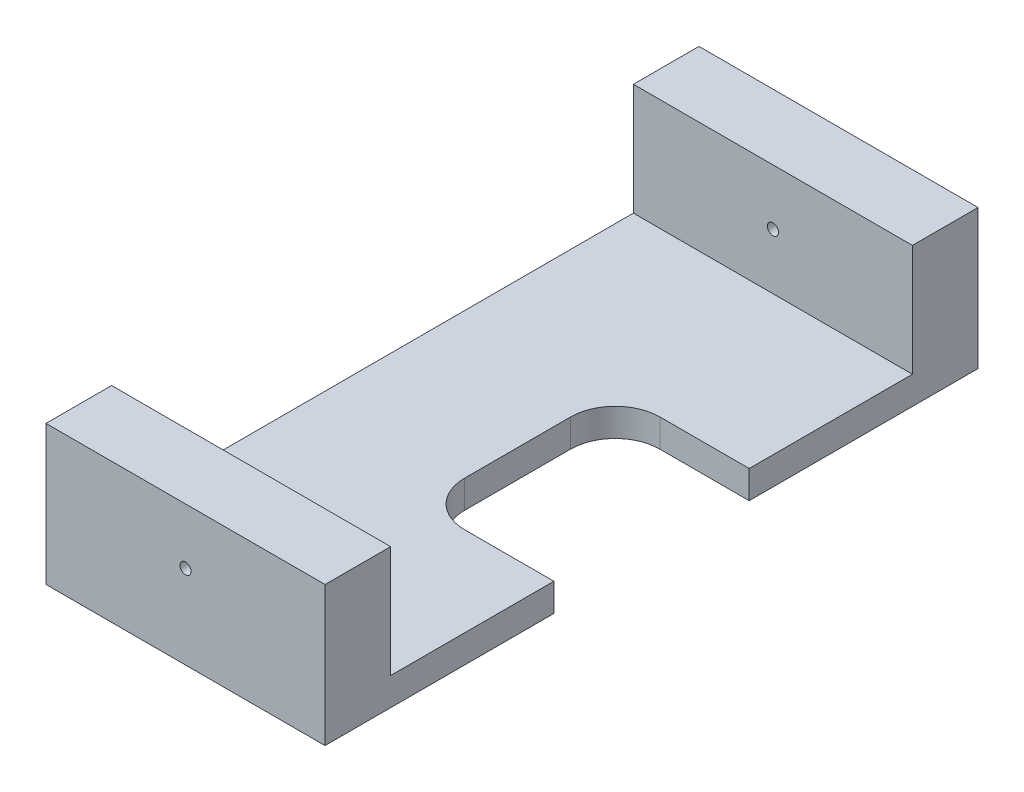
ISO-10303-21;
HEADER;
FILE_DESCRIPTION(('STEP AP214'),'2;1');
FILE_NAME('part.step','',(''),(''),'','','');
FILE_SCHEMA(('AUTOMOTIVE_DESIGN { 1 0 10303 214 1 1 1 1 }'));
ENDSEC;
DATA;
#1=APPLICATION_CONTEXT('core data for automotive mechanical design processes');
#2=APPLICATION_PROTOCOL_DEFINITION('international standard','automotive_design',2000,#1);
#3=PRODUCT_CONTEXT('',#1,'mechanical');
#4=PRODUCT('Part','Part','',(#3));
#5=PRODUCT_RELATED_PRODUCT_CATEGORY('part','',(#4));
#6=PRODUCT_DEFINITION_FORMATION('','',#4);
#7=PRODUCT_DEFINITION_CONTEXT('part definition',#1,'design');
#8=PRODUCT_DEFINITION('design','',#6,#7);
#9=PRODUCT_DEFINITION_SHAPE('','',#8);
#10=(LENGTH_UNIT() NAMED_UNIT(*) SI_UNIT(.MILLI.,.METRE.));
#11=(NAMED_UNIT(*) PLANE_ANGLE_UNIT() SI_UNIT($,.RADIAN.));
#12=(NAMED_UNIT(*) SI_UNIT($,.STERADIAN.) SOLID_ANGLE_UNIT());
#13=UNCERTAINTY_MEASURE_WITH_UNIT(LENGTH_MEASURE(1.E-05),#10,'distance_accuracy_value','');
#14=(GEOMETRIC_REPRESENTATION_CONTEXT(3) GLOBAL_UNCERTAINTY_ASSIGNED_CONTEXT((#13)) GLOBAL_UNIT_ASSIGNED_CONTEXT((#10,
#11,#12)) REPRESENTATION_CONTEXT('',''));
#15=CARTESIAN_POINT('',(0.,0.,0.));
#16=DIRECTION('',(0.,0.,1.));
#17=DIRECTION('',(1.,0.,0.));
#18=AXIS2_PLACEMENT_3D('',#15,#16,#17);
#19=CARTESIAN_POINT('',(25.,5.,58.5));
#20=DIRECTION('',(-1.,0.,0.));
#21=DIRECTION('',(0.,0.,1.));
#22=AXIS2_PLACEMENT_3D('',#19,#20,#21);
#23=PLANE('',#22);
#24=DIRECTION('',(0.,0.,-1.));
#25=VECTOR('',#24,1.);
#26=CARTESIAN_POINT('',(25.,0.,58.5));
#27=LINE('',#26,#25);
#28=CARTESIAN_POINT('',(25.,0.,58.5));
#29=VERTEX_POINT('',#28);
#30=CARTESIAN_POINT('',(25.,0.,17.5));
#31=VERTEX_POINT('',#30);
#32=EDGE_CURVE('E194',#29,#31,#27,.T.);
#33=ORIENTED_EDGE('',*,*,#32,.T.);
#34=DIRECTION('',(0.,1.,0.));
#35=VECTOR('',#34,1.);
#36=CARTESIAN_POINT('',(25.,-5.,17.5));
#37=LINE('',#36,#35);
#38=CARTESIAN_POINT('',(25.,5.,17.5));
#39=VERTEX_POINT('',#38);
#40=EDGE_CURVE('E270',#31,#39,#37,.T.);
#41=ORIENTED_EDGE('',*,*,#40,.T.);
#42=DIRECTION('',(0.,0.,-1.));
#43=VECTOR('',#42,1.);
#44=CARTESIAN_POINT('',(25.,5.,58.5));
#45=LINE('',#44,#43);
#46=CARTESIAN_POINT('',(25.,5.,46.75));
#47=VERTEX_POINT('',#46);
#48=EDGE_CURVE('E175',#47,#39,#45,.T.);
#49=ORIENTED_EDGE('',*,*,#48,.F.);
#50=DIRECTION('',(0.,-1.,0.));
#51=VECTOR('',#50,1.);
#52=CARTESIAN_POINT('',(25.,25.,46.75));
#53=LINE('',#52,#51);
#54=CARTESIAN_POINT('',(25.,25.,46.75));
#55=VERTEX_POINT('',#54);
#56=EDGE_CURVE('E274',#55,#47,#53,.T.);
#57=ORIENTED_EDGE('',*,*,#56,.F.);
#58=DIRECTION('',(0.,0.,-1.));
#59=VECTOR('',#58,1.);
#60=CARTESIAN_POINT('',(25.,25.,46.75));
#61=LINE('',#60,#59);
#62=CARTESIAN_POINT('',(25.,25.,58.5));
#63=VERTEX_POINT('',#62);
#64=EDGE_CURVE('E256',#63,#55,#61,.T.);
#65=ORIENTED_EDGE('',*,*,#64,.F.);
#66=DIRECTION('',(0.,-1.,0.));
#67=VECTOR('',#66,1.);
#68=CARTESIAN_POINT('',(25.,5.,58.5));
#69=LINE('',#68,#67);
#70=EDGE_CURVE('E203',#63,#29,#69,.T.);
#71=ORIENTED_EDGE('',*,*,#70,.T.);
#72=EDGE_LOOP('',(#33,#41,#49,#57,#65,#71));
#73=FACE_BOUND('',#72,.T.);
#74=ADVANCED_FACE('F45',(#73),#23,.F.);
#75=CARTESIAN_POINT('',(0.,5.,0.));
#76=DIRECTION('',(0.,-1.,0.));
#77=DIRECTION('',(0.,0.,-1.));
#78=AXIS2_PLACEMENT_3D('',#75,#76,#77);
#79=PLANE('',#78);
#80=ORIENTED_EDGE('',*,*,#48,.T.);
#81=DIRECTION('',(1.,0.,0.));
#82=VECTOR('',#81,1.);
#83=CARTESIAN_POINT('',(9.00000000000006,5.,17.5));
#84=LINE('',#83,#82);
#85=CARTESIAN_POINT('',(9.,5.,17.5));
#86=VERTEX_POINT('',#85);
#87=EDGE_CURVE('E157',#86,#39,#84,.T.);
#88=ORIENTED_EDGE('',*,*,#87,.F.);
#89=CARTESIAN_POINT('',(9.,5.,9.50000000000001));
#90=DIRECTION('',(0.,1.,0.));
#91=DIRECTION('',(0.,0.,1.));
#92=AXIS2_PLACEMENT_3D('',#89,#90,#91);
#93=CIRCLE('',#92,8.);
#94=CARTESIAN_POINT('',(1.,5.,9.49999999999995));
#95=VERTEX_POINT('',#94);
#96=EDGE_CURVE('E323',#95,#86,#93,.T.);
#97=ORIENTED_EDGE('',*,*,#96,.F.);
#98=DIRECTION('',(0.,0.,1.));
#99=VECTOR('',#98,1.);
#100=CARTESIAN_POINT('',(1.,5.,-9.49999999999994));
#101=LINE('',#100,#99);
#102=CARTESIAN_POINT('',(1.,5.,-9.49999999999994));
#103=VERTEX_POINT('',#102);
#104=EDGE_CURVE('E237',#103,#95,#101,.T.);
#105=ORIENTED_EDGE('',*,*,#104,.F.);
#106=CARTESIAN_POINT('',(9.,5.,-9.5));
#107=DIRECTION('',(0.,1.,0.));
#108=DIRECTION('',(0.,0.,1.));
#109=AXIS2_PLACEMENT_3D('',#106,#107,#108);
#110=CIRCLE('',#109,8.);
#111=CARTESIAN_POINT('',(9.00000000000006,5.,-17.5));
#112=VERTEX_POINT('',#111);
#113=EDGE_CURVE('E165',#112,#103,#110,.T.);
#114=ORIENTED_EDGE('',*,*,#113,.F.);
#115=DIRECTION('',(-1.,0.,0.));
#116=VECTOR('',#115,1.);
#117=CARTESIAN_POINT('',(25.,5.,-17.5));
#118=LINE('',#117,#116);
#119=CARTESIAN_POINT('',(25.,5.,-17.5));
#120=VERTEX_POINT('',#119);
#121=EDGE_CURVE('E149',#120,#112,#118,.T.);
#122=ORIENTED_EDGE('',*,*,#121,.F.);
#123=CARTESIAN_POINT('',(25.,5.,-46.75));
#124=VERTEX_POINT('',#123);
#125=EDGE_CURVE('E161',#120,#124,#45,.T.);
#126=ORIENTED_EDGE('',*,*,#125,.T.);
#127=DIRECTION('',(1.,0.,0.));
#128=VECTOR('',#127,1.);
#129=CARTESIAN_POINT('',(-25.,5.,-46.75));
#130=LINE('',#129,#128);
#131=CARTESIAN_POINT('',(-25.,5.,-46.75));
#132=VERTEX_POINT('',#131);
#133=EDGE_CURVE('E278',#132,#124,#130,.T.);
#134=ORIENTED_EDGE('',*,*,#133,.F.);
#135=DIRECTION('',(0.,0.,-1.));
#136=VECTOR('',#135,1.);
#137=CARTESIAN_POINT('',(-25.,5.,58.5));
#138=LINE('',#137,#136);
#139=CARTESIAN_POINT('',(-25.,5.,46.75));
#140=VERTEX_POINT('',#139);
#141=EDGE_CURVE('E70',#140,#132,#138,.T.);
#142=ORIENTED_EDGE('',*,*,#141,.F.);
#143=DIRECTION('',(-1.,0.,0.));
#144=VECTOR('',#143,1.);
#145=CARTESIAN_POINT('',(-25.,5.,46.75));
#146=LINE('',#145,#144);
#147=EDGE_CURVE('E257',#47,#140,#146,.T.);
#148=ORIENTED_EDGE('',*,*,#147,.F.);
#149=EDGE_LOOP('',(#80,#88,#97,#105,#114,#122,#126,#134,#142,#148));
#150=FACE_BOUND('',#149,.T.);
#151=ADVANCED_FACE('F160',(#150),#79,.F.);
#152=CARTESIAN_POINT('',(-25.,5.,58.5));
#153=DIRECTION('',(-1.,0.,0.));
#154=DIRECTION('',(0.,0.,1.));
#155=AXIS2_PLACEMENT_3D('',#152,#153,#154);
#156=PLANE('',#155);
#157=DIRECTION('',(0.,0.,-1.));
#158=VECTOR('',#157,1.);
#159=CARTESIAN_POINT('',(-25.,0.,58.5));
#160=LINE('',#159,#158);
#161=CARTESIAN_POINT('',(-25.,0.,58.5));
#162=VERTEX_POINT('',#161);
#163=CARTESIAN_POINT('',(-25.,0.,-58.5));
#164=VERTEX_POINT('',#163);
#165=EDGE_CURVE('E184',#162,#164,#160,.T.);
#166=ORIENTED_EDGE('',*,*,#165,.F.);
#167=DIRECTION('',(0.,-1.,0.));
#168=VECTOR('',#167,1.);
#169=CARTESIAN_POINT('',(-25.,5.,58.5));
#170=LINE('',#169,#168);
#171=CARTESIAN_POINT('',(-25.,25.,58.5));
#172=VERTEX_POINT('',#171);
#173=EDGE_CURVE('E200',#172,#162,#170,.T.);
#174=ORIENTED_EDGE('',*,*,#173,.F.);
#175=DIRECTION('',(0.,0.,1.));
#176=VECTOR('',#175,1.);
#177=CARTESIAN_POINT('',(-25.,25.,58.5));
#178=LINE('',#177,#176);
#179=CARTESIAN_POINT('',(-25.,25.,46.75));
#180=VERTEX_POINT('',#179);
#181=EDGE_CURVE('E263',#180,#172,#178,.T.);
#182=ORIENTED_EDGE('',*,*,#181,.F.);
#183=DIRECTION('',(0.,-1.,0.));
#184=VECTOR('',#183,1.);
#185=CARTESIAN_POINT('',(-25.,25.,46.75));
#186=LINE('',#185,#184);
#187=EDGE_CURVE('E267',#180,#140,#186,.T.);
#188=ORIENTED_EDGE('',*,*,#187,.T.);
#189=ORIENTED_EDGE('',*,*,#141,.T.);
#190=DIRECTION('',(0.,-1.,0.));
#191=VECTOR('',#190,1.);
#192=CARTESIAN_POINT('',(-25.,25.,-46.75));
#193=LINE('',#192,#191);
#194=CARTESIAN_POINT('',(-25.,25.,-46.75));
#195=VERTEX_POINT('',#194);
#196=EDGE_CURVE('E189',#195,#132,#193,.T.);
#197=ORIENTED_EDGE('',*,*,#196,.F.);
#198=DIRECTION('',(0.,0.,1.));
#199=VECTOR('',#198,1.);
#200=CARTESIAN_POINT('',(-25.,25.,-58.5));
#201=LINE('',#200,#199);
#202=CARTESIAN_POINT('',(-25.,25.,-58.5));
#203=VERTEX_POINT('',#202);
#204=EDGE_CURVE('E283',#203,#195,#201,.T.);
#205=ORIENTED_EDGE('',*,*,#204,.F.);
#206=DIRECTION('',(0.,-1.,0.));
#207=VECTOR('',#206,1.);
#208=CARTESIAN_POINT('',(-25.,5.,-58.5));
#209=LINE('',#208,#207);
#210=EDGE_CURVE('E179',#203,#164,#209,.T.);
#211=ORIENTED_EDGE('',*,*,#210,.T.);
#212=EDGE_LOOP('',(#166,#174,#182,#188,#189,#197,#205,#211));
#213=FACE_BOUND('',#212,.T.);
#214=ADVANCED_FACE('F47',(#213),#156,.T.);
#215=CARTESIAN_POINT('',(-25.,5.,58.5));
#216=DIRECTION('',(0.,0.,-1.));
#217=DIRECTION('',(-1.,0.,0.));
#218=AXIS2_PLACEMENT_3D('',#215,#216,#217);
#219=PLANE('',#218);
#220=CARTESIAN_POINT('',(0.,15.,58.5));
#221=DIRECTION('',(0.,0.,-1.));
#222=DIRECTION('',(-1.,0.,0.));
#223=AXIS2_PLACEMENT_3D('',#220,#221,#222);
#224=CIRCLE('',#223,1.);
#225=CARTESIAN_POINT('',(-1.,15.,58.5));
#226=VERTEX_POINT('',#225);
#227=EDGE_CURVE('E337',#226,#226,#224,.T.);
#228=ORIENTED_EDGE('',*,*,#227,.T.);
#229=EDGE_LOOP('',(#228));
#230=FACE_BOUND('',#229,.T.);
#231=DIRECTION('',(1.,0.,0.));
#232=VECTOR('',#231,1.);
#233=CARTESIAN_POINT('',(-25.,0.,58.5));
#234=LINE('',#233,#232);
#235=EDGE_CURVE('E180',#162,#29,#234,.T.);
#236=ORIENTED_EDGE('',*,*,#235,.T.);
#237=ORIENTED_EDGE('',*,*,#70,.F.);
#238=DIRECTION('',(1.,0.,0.));
#239=VECTOR('',#238,1.);
#240=CARTESIAN_POINT('',(25.,25.,58.5));
#241=LINE('',#240,#239);
#242=EDGE_CURVE('E252',#172,#63,#241,.T.);
#243=ORIENTED_EDGE('',*,*,#242,.F.);
#244=ORIENTED_EDGE('',*,*,#173,.T.);
#245=EDGE_LOOP('',(#236,#237,#243,#244));
#246=FACE_BOUND('',#245,.T.);
#247=ADVANCED_FACE('F368',(#230,#246),#219,.F.);
#248=ORIENTED_EDGE('',*,*,#125,.F.);
#249=DIRECTION('',(0.,1.,0.));
#250=VECTOR('',#249,1.);
#251=CARTESIAN_POINT('',(25.,-5.,-17.5));
#252=LINE('',#251,#250);
#253=CARTESIAN_POINT('',(25.,0.,-17.5));
#254=VERTEX_POINT('',#253);
#255=EDGE_CURVE('E146',#254,#120,#252,.T.);
#256=ORIENTED_EDGE('',*,*,#255,.F.);
#257=CARTESIAN_POINT('',(25.,0.,-58.5));
#258=VERTEX_POINT('',#257);
#259=EDGE_CURVE('E193',#254,#258,#27,.T.);
#260=ORIENTED_EDGE('',*,*,#259,.T.);
#261=DIRECTION('',(0.,-1.,0.));
#262=VECTOR('',#261,1.);
#263=CARTESIAN_POINT('',(25.,5.,-58.5));
#264=LINE('',#263,#262);
#265=CARTESIAN_POINT('',(25.,25.,-58.5));
#266=VERTEX_POINT('',#265);
#267=EDGE_CURVE('E207',#266,#258,#264,.T.);
#268=ORIENTED_EDGE('',*,*,#267,.F.);
#269=DIRECTION('',(0.,0.,-1.));
#270=VECTOR('',#269,1.);
#271=CARTESIAN_POINT('',(25.,25.,-46.75));
#272=LINE('',#271,#270);
#273=CARTESIAN_POINT('',(25.,25.,-46.75));
#274=VERTEX_POINT('',#273);
#275=EDGE_CURVE('E289',#274,#266,#272,.T.);
#276=ORIENTED_EDGE('',*,*,#275,.F.);
#277=DIRECTION('',(0.,-1.,0.));
#278=VECTOR('',#277,1.);
#279=CARTESIAN_POINT('',(25.,25.,-46.75));
#280=LINE('',#279,#278);
#281=EDGE_CURVE('E173',#274,#124,#280,.T.);
#282=ORIENTED_EDGE('',*,*,#281,.T.);
#283=EDGE_LOOP('',(#248,#256,#260,#268,#276,#282));
#284=FACE_BOUND('',#283,.T.);
#285=ADVANCED_FACE('F170',(#284),#23,.F.);
#286=CARTESIAN_POINT('',(-25.,5.,-58.5));
#287=DIRECTION('',(0.,0.,-1.));
#288=DIRECTION('',(-1.,0.,0.));
#289=AXIS2_PLACEMENT_3D('',#286,#287,#288);
#290=PLANE('',#289);
#291=CARTESIAN_POINT('',(0.,15.,-58.5));
#292=DIRECTION('',(0.,0.,-1.));
#293=DIRECTION('',(-1.,0.,0.));
#294=AXIS2_PLACEMENT_3D('',#291,#292,#293);
#295=CIRCLE('',#294,1.);
#296=CARTESIAN_POINT('',(-1.,15.,-58.5));
#297=VERTEX_POINT('',#296);
#298=EDGE_CURVE('E333',#297,#297,#295,.T.);
#299=ORIENTED_EDGE('',*,*,#298,.F.);
#300=EDGE_LOOP('',(#299));
#301=FACE_BOUND('',#300,.T.);
#302=DIRECTION('',(1.,0.,0.));
#303=VECTOR('',#302,1.);
#304=CARTESIAN_POINT('',(-25.,0.,-58.5));
#305=LINE('',#304,#303);
#306=EDGE_CURVE('E188',#164,#258,#305,.T.);
#307=ORIENTED_EDGE('',*,*,#306,.F.);
#308=ORIENTED_EDGE('',*,*,#210,.F.);
#309=DIRECTION('',(-1.,0.,0.));
#310=VECTOR('',#309,1.);
#311=CARTESIAN_POINT('',(25.,25.,-58.5));
#312=LINE('',#311,#310);
#313=EDGE_CURVE('E279',#266,#203,#312,.T.);
#314=ORIENTED_EDGE('',*,*,#313,.F.);
#315=ORIENTED_EDGE('',*,*,#267,.T.);
#316=EDGE_LOOP('',(#307,#308,#314,#315));
#317=FACE_BOUND('',#316,.T.);
#318=ADVANCED_FACE('F367',(#301,#317),#290,.T.);
#319=CARTESIAN_POINT('',(0.,0.,0.));
#320=DIRECTION('',(0.,-1.,0.));
#321=DIRECTION('',(0.,0.,-1.));
#322=AXIS2_PLACEMENT_3D('',#319,#320,#321);
#323=PLANE('',#322);
#324=DIRECTION('',(-1.,0.,0.));
#325=VECTOR('',#324,1.);
#326=CARTESIAN_POINT('',(0.,0.,17.5));
#327=LINE('',#326,#325);
#328=CARTESIAN_POINT('',(9.,0.,17.5));
#329=VERTEX_POINT('',#328);
#330=EDGE_CURVE('E11',#31,#329,#327,.T.);
#331=ORIENTED_EDGE('',*,*,#330,.F.);
#332=ORIENTED_EDGE('',*,*,#32,.F.);
#333=ORIENTED_EDGE('',*,*,#235,.F.);
#334=ORIENTED_EDGE('',*,*,#165,.T.);
#335=ORIENTED_EDGE('',*,*,#306,.T.);
#336=ORIENTED_EDGE('',*,*,#259,.F.);
#337=DIRECTION('',(1.,0.,0.));
#338=VECTOR('',#337,1.);
#339=CARTESIAN_POINT('',(0.,0.,-17.5));
#340=LINE('',#339,#338);
#341=CARTESIAN_POINT('',(9.00000000000006,0.,-17.5));
#342=VERTEX_POINT('',#341);
#343=EDGE_CURVE('E152',#342,#254,#340,.T.);
#344=ORIENTED_EDGE('',*,*,#343,.F.);
#345=CARTESIAN_POINT('',(9.,0.,-9.5));
#346=DIRECTION('',(0.,-1.,0.));
#347=DIRECTION('',(0.,0.,-1.));
#348=AXIS2_PLACEMENT_3D('',#345,#346,#347);
#349=CIRCLE('',#348,8.);
#350=CARTESIAN_POINT('',(1.,0.,-9.49999999999994));
#351=VERTEX_POINT('',#350);
#352=EDGE_CURVE('E215',#351,#342,#349,.T.);
#353=ORIENTED_EDGE('',*,*,#352,.F.);
#354=DIRECTION('',(0.,0.,-1.));
#355=VECTOR('',#354,1.);
#356=CARTESIAN_POINT('',(1.,0.,0.));
#357=LINE('',#356,#355);
#358=CARTESIAN_POINT('',(1.,0.,9.49999999999995));
#359=VERTEX_POINT('',#358);
#360=EDGE_CURVE('E218',#359,#351,#357,.T.);
#361=ORIENTED_EDGE('',*,*,#360,.F.);
#362=CARTESIAN_POINT('',(9.,0.,9.50000000000001));
#363=DIRECTION('',(0.,-1.,0.));
#364=DIRECTION('',(0.,0.,-1.));
#365=AXIS2_PLACEMENT_3D('',#362,#363,#364);
#366=CIRCLE('',#365,8.);
#367=EDGE_CURVE('E55',#329,#359,#366,.T.);
#368=ORIENTED_EDGE('',*,*,#367,.F.);
#369=EDGE_LOOP('',(#331,#332,#333,#334,#335,#336,#344,#353,#361,#368));
#370=FACE_BOUND('',#369,.T.);
#371=ADVANCED_FACE('F243',(#370),#323,.T.);
#372=CARTESIAN_POINT('',(-25.,25.,-46.75));
#373=DIRECTION('',(0.,0.,-1.));
#374=DIRECTION('',(-1.,0.,0.));
#375=AXIS2_PLACEMENT_3D('',#372,#373,#374);
#376=PLANE('',#375);
#377=CARTESIAN_POINT('',(0.,15.,-46.75));
#378=DIRECTION('',(0.,0.,-1.));
#379=DIRECTION('',(-1.,0.,0.));
#380=AXIS2_PLACEMENT_3D('',#377,#378,#379);
#381=CIRCLE('',#380,1.);
#382=CARTESIAN_POINT('',(-1.,15.,-46.75));
#383=VERTEX_POINT('',#382);
#384=EDGE_CURVE('E167',#383,#383,#381,.T.);
#385=ORIENTED_EDGE('',*,*,#384,.T.);
#386=EDGE_LOOP('',(#385));
#387=FACE_BOUND('',#386,.T.);
#388=ORIENTED_EDGE('',*,*,#133,.T.);
#389=ORIENTED_EDGE('',*,*,#281,.F.);
#390=DIRECTION('',(1.,0.,0.));
#391=VECTOR('',#390,1.);
#392=CARTESIAN_POINT('',(-25.,25.,-46.75));
#393=LINE('',#392,#391);
#394=EDGE_CURVE('E286',#195,#274,#393,.T.);
#395=ORIENTED_EDGE('',*,*,#394,.F.);
#396=ORIENTED_EDGE('',*,*,#196,.T.);
#397=EDGE_LOOP('',(#388,#389,#395,#396));
#398=FACE_BOUND('',#397,.T.);
#399=ADVANCED_FACE('F301',(#387,#398),#376,.F.);
#400=CARTESIAN_POINT('',(0.,25.,0.));
#401=DIRECTION('',(0.,1.,0.));
#402=DIRECTION('',(0.,0.,1.));
#403=AXIS2_PLACEMENT_3D('',#400,#401,#402);
#404=PLANE('',#403);
#405=ORIENTED_EDGE('',*,*,#313,.T.);
#406=ORIENTED_EDGE('',*,*,#204,.T.);
#407=ORIENTED_EDGE('',*,*,#394,.T.);
#408=ORIENTED_EDGE('',*,*,#275,.T.);
#409=EDGE_LOOP('',(#405,#406,#407,#408));
#410=FACE_BOUND('',#409,.T.);
#411=ADVANCED_FACE('F383',(#410),#404,.T.);
#412=CARTESIAN_POINT('',(-25.,25.,46.75));
#413=DIRECTION('',(0.,0.,1.));
#414=DIRECTION('',(1.,0.,0.));
#415=AXIS2_PLACEMENT_3D('',#412,#413,#414);
#416=PLANE('',#415);
#417=CARTESIAN_POINT('',(0.,15.,46.75));
#418=DIRECTION('',(0.,0.,1.));
#419=DIRECTION('',(1.,0.,0.));
#420=AXIS2_PLACEMENT_3D('',#417,#418,#419);
#421=CIRCLE('',#420,1.);
#422=CARTESIAN_POINT('',(1.,15.,46.75));
#423=VERTEX_POINT('',#422);
#424=EDGE_CURVE('E49',#423,#423,#421,.T.);
#425=ORIENTED_EDGE('',*,*,#424,.T.);
#426=EDGE_LOOP('',(#425));
#427=FACE_BOUND('',#426,.T.);
#428=ORIENTED_EDGE('',*,*,#147,.T.);
#429=ORIENTED_EDGE('',*,*,#187,.F.);
#430=DIRECTION('',(-1.,0.,0.));
#431=VECTOR('',#430,1.);
#432=CARTESIAN_POINT('',(-25.,25.,46.75));
#433=LINE('',#432,#431);
#434=EDGE_CURVE('E260',#55,#180,#433,.T.);
#435=ORIENTED_EDGE('',*,*,#434,.F.);
#436=ORIENTED_EDGE('',*,*,#56,.T.);
#437=EDGE_LOOP('',(#428,#429,#435,#436));
#438=FACE_BOUND('',#437,.T.);
#439=ADVANCED_FACE('F309',(#427,#438),#416,.F.);
#440=CARTESIAN_POINT('',(0.,25.,0.));
#441=DIRECTION('',(0.,-1.,0.));
#442=DIRECTION('',(0.,0.,-1.));
#443=AXIS2_PLACEMENT_3D('',#440,#441,#442);
#444=PLANE('',#443);
#445=ORIENTED_EDGE('',*,*,#242,.T.);
#446=ORIENTED_EDGE('',*,*,#64,.T.);
#447=ORIENTED_EDGE('',*,*,#434,.T.);
#448=ORIENTED_EDGE('',*,*,#181,.T.);
#449=EDGE_LOOP('',(#445,#446,#447,#448));
#450=FACE_BOUND('',#449,.T.);
#451=ADVANCED_FACE('F390',(#450),#444,.F.);
#452=CARTESIAN_POINT('',(9.00000000000006,-5.,17.5));
#453=DIRECTION('',(0.,0.,1.));
#454=DIRECTION('',(1.,0.,0.));
#455=AXIS2_PLACEMENT_3D('',#452,#453,#454);
#456=PLANE('',#455);
#457=ORIENTED_EDGE('',*,*,#330,.T.);
#458=DIRECTION('',(0.,1.,0.));
#459=VECTOR('',#458,1.);
#460=CARTESIAN_POINT('',(9.,-5.,17.5));
#461=LINE('',#460,#459);
#462=EDGE_CURVE('E230',#329,#86,#461,.T.);
#463=ORIENTED_EDGE('',*,*,#462,.T.);
#464=ORIENTED_EDGE('',*,*,#87,.T.);
#465=ORIENTED_EDGE('',*,*,#40,.F.);
#466=EDGE_LOOP('',(#457,#463,#464,#465));
#467=FACE_BOUND('',#466,.T.);
#468=ADVANCED_FACE('F392',(#467),#456,.F.);
#469=CARTESIAN_POINT('',(9.,-5.,9.50000000000001));
#470=DIRECTION('',(0.,1.,0.));
#471=DIRECTION('',(0.,0.,1.));
#472=AXIS2_PLACEMENT_3D('',#469,#470,#471);
#473=CYLINDRICAL_SURFACE('',#472,8.);
#474=ORIENTED_EDGE('',*,*,#367,.T.);
#475=DIRECTION('',(0.,1.,0.));
#476=VECTOR('',#475,1.);
#477=CARTESIAN_POINT('',(1.,-5.,9.49999999999995));
#478=LINE('',#477,#476);
#479=EDGE_CURVE('E228',#359,#95,#478,.T.);
#480=ORIENTED_EDGE('',*,*,#479,.T.);
#481=ORIENTED_EDGE('',*,*,#96,.T.);
#482=ORIENTED_EDGE('',*,*,#462,.F.);
#483=EDGE_LOOP('',(#474,#480,#481,#482));
#484=FACE_BOUND('',#483,.T.);
#485=ADVANCED_FACE('F226',(#484),#473,.F.);
#486=CARTESIAN_POINT('',(1.,-5.,-9.49999999999994));
#487=DIRECTION('',(-1.,0.,0.));
#488=DIRECTION('',(0.,0.,1.));
#489=AXIS2_PLACEMENT_3D('',#486,#487,#488);
#490=PLANE('',#489);
#491=ORIENTED_EDGE('',*,*,#360,.T.);
#492=DIRECTION('',(0.,1.,0.));
#493=VECTOR('',#492,1.);
#494=CARTESIAN_POINT('',(1.,-5.,-9.49999999999994));
#495=LINE('',#494,#493);
#496=EDGE_CURVE('E240',#351,#103,#495,.T.);
#497=ORIENTED_EDGE('',*,*,#496,.T.);
#498=ORIENTED_EDGE('',*,*,#104,.T.);
#499=ORIENTED_EDGE('',*,*,#479,.F.);
#500=EDGE_LOOP('',(#491,#497,#498,#499));
#501=FACE_BOUND('',#500,.T.);
#502=ADVANCED_FACE('F235',(#501),#490,.F.);
#503=CARTESIAN_POINT('',(9.,-5.,-9.5));
#504=DIRECTION('',(0.,1.,0.));
#505=DIRECTION('',(0.,0.,1.));
#506=AXIS2_PLACEMENT_3D('',#503,#504,#505);
#507=CYLINDRICAL_SURFACE('',#506,8.);
#508=ORIENTED_EDGE('',*,*,#352,.T.);
#509=DIRECTION('',(0.,1.,0.));
#510=VECTOR('',#509,1.);
#511=CARTESIAN_POINT('',(9.00000000000006,-5.,-17.5));
#512=LINE('',#511,#510);
#513=EDGE_CURVE('E62',#342,#112,#512,.T.);
#514=ORIENTED_EDGE('',*,*,#513,.T.);
#515=ORIENTED_EDGE('',*,*,#113,.T.);
#516=ORIENTED_EDGE('',*,*,#496,.F.);
#517=EDGE_LOOP('',(#508,#514,#515,#516));
#518=FACE_BOUND('',#517,.T.);
#519=ADVANCED_FACE('F245',(#518),#507,.F.);
#520=CARTESIAN_POINT('',(25.,-5.,-17.5));
#521=DIRECTION('',(0.,0.,-1.));
#522=DIRECTION('',(-1.,0.,0.));
#523=AXIS2_PLACEMENT_3D('',#520,#521,#522);
#524=PLANE('',#523);
#525=ORIENTED_EDGE('',*,*,#343,.T.);
#526=ORIENTED_EDGE('',*,*,#255,.T.);
#527=ORIENTED_EDGE('',*,*,#121,.T.);
#528=ORIENTED_EDGE('',*,*,#513,.F.);
#529=EDGE_LOOP('',(#525,#526,#527,#528));
#530=FACE_BOUND('',#529,.T.);
#531=ADVANCED_FACE('F148',(#530),#524,.F.);
#532=CARTESIAN_POINT('',(0.,15.,58.5));
#533=DIRECTION('',(0.,0.,-1.));
#534=DIRECTION('',(-1.,0.,0.));
#535=AXIS2_PLACEMENT_3D('',#532,#533,#534);
#536=CYLINDRICAL_SURFACE('',#535,1.);
#537=ORIENTED_EDGE('',*,*,#227,.F.);
#538=EDGE_LOOP('',(#537));
#539=FACE_BOUND('',#538,.T.);
#540=ORIENTED_EDGE('',*,*,#424,.F.);
#541=EDGE_LOOP('',(#540));
#542=FACE_BOUND('',#541,.T.);
#543=ADVANCED_FACE('F347',(#539,#542),#536,.F.);
#544=ORIENTED_EDGE('',*,*,#298,.T.);
#545=EDGE_LOOP('',(#544));
#546=FACE_BOUND('',#545,.T.);
#547=ORIENTED_EDGE('',*,*,#384,.F.);
#548=EDGE_LOOP('',(#547));
#549=FACE_BOUND('',#548,.T.);
#550=ADVANCED_FACE('F349',(#546,#549),#536,.F.);
#551=CLOSED_SHELL('',(#74,#151,#214,#247,#285,#318,#371,#399,#411,#439,#451,#468,#485,#502,#519,
#531,#543,#550));
#552=MANIFOLD_SOLID_BREP('B2',#551);
#553=ADVANCED_BREP_SHAPE_REPRESENTATION('',(#18,#552),#14);
#554=SHAPE_DEFINITION_REPRESENTATION(#9,#553);
ENDSEC;
END-ISO-10303-21;
